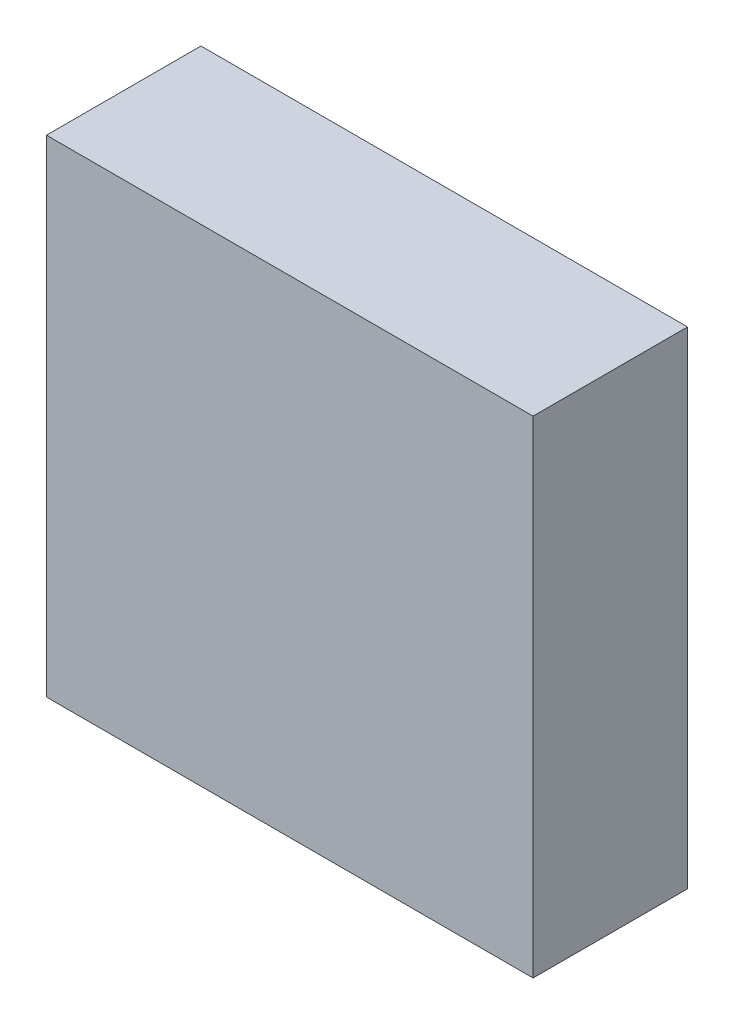
ISO-10303-21;
HEADER;
FILE_DESCRIPTION(('STEP AP214'),'2;1');
FILE_NAME('part.step','',(''),(''),'','','');
FILE_SCHEMA(('AUTOMOTIVE_DESIGN { 1 0 10303 214 1 1 1 1 }'));
ENDSEC;
DATA;
#1=APPLICATION_CONTEXT('core data for automotive mechanical design processes');
#2=APPLICATION_PROTOCOL_DEFINITION('international standard','automotive_design',2000,#1);
#3=PRODUCT_CONTEXT('',#1,'mechanical');
#4=PRODUCT('Part','Part','',(#3));
#5=PRODUCT_RELATED_PRODUCT_CATEGORY('part','',(#4));
#6=PRODUCT_DEFINITION_FORMATION('','',#4);
#7=PRODUCT_DEFINITION_CONTEXT('part definition',#1,'design');
#8=PRODUCT_DEFINITION('design','',#6,#7);
#9=PRODUCT_DEFINITION_SHAPE('','',#8);
#10=(LENGTH_UNIT() NAMED_UNIT(*) SI_UNIT(.MILLI.,.METRE.));
#11=(NAMED_UNIT(*) PLANE_ANGLE_UNIT() SI_UNIT($,.RADIAN.));
#12=(NAMED_UNIT(*) SI_UNIT($,.STERADIAN.) SOLID_ANGLE_UNIT());
#13=UNCERTAINTY_MEASURE_WITH_UNIT(LENGTH_MEASURE(1.E-05),#10,'distance_accuracy_value','');
#14=(GEOMETRIC_REPRESENTATION_CONTEXT(3) GLOBAL_UNCERTAINTY_ASSIGNED_CONTEXT((#13)) GLOBAL_UNIT_ASSIGNED_CONTEXT((#10,
#11,#12)) REPRESENTATION_CONTEXT('',''));
#15=CARTESIAN_POINT('',(0.,0.,0.));
#16=DIRECTION('',(0.,0.,1.));
#17=DIRECTION('',(1.,0.,0.));
#18=AXIS2_PLACEMENT_3D('',#15,#16,#17);
#19=CARTESIAN_POINT('',(1.57500066,1.57500066,1.00000054));
#20=DIRECTION('',(0.,0.,1.));
#21=DIRECTION('',(1.,0.,0.));
#22=AXIS2_PLACEMENT_3D('',#19,#20,#21);
#23=PLANE('',#22);
#24=DIRECTION('',(1.,0.,0.));
#25=VECTOR('',#24,1.);
#26=CARTESIAN_POINT('',(1.57500066,-1.57499812,1.00000054));
#27=LINE('',#26,#25);
#28=CARTESIAN_POINT('',(1.57500066,-1.57499812,1.00000054));
#29=VERTEX_POINT('',#28);
#30=CARTESIAN_POINT('',(-1.57499812,-1.57499812,1.00000054));
#31=VERTEX_POINT('',#30);
#32=EDGE_CURVE('E53',#29,#31,#27,.F.);
#33=ORIENTED_EDGE('',*,*,#32,.F.);
#34=DIRECTION('',(0.,1.,0.));
#35=VECTOR('',#34,1.);
#36=CARTESIAN_POINT('',(1.57500066,1.57500066,1.00000054));
#37=LINE('',#36,#35);
#38=CARTESIAN_POINT('',(1.57500066,1.57500066,1.00000054));
#39=VERTEX_POINT('',#38);
#40=EDGE_CURVE('E68',#39,#29,#37,.F.);
#41=ORIENTED_EDGE('',*,*,#40,.F.);
#42=DIRECTION('',(1.,0.,0.));
#43=VECTOR('',#42,1.);
#44=CARTESIAN_POINT('',(-1.57499812,1.57500066,1.00000054));
#45=LINE('',#44,#43);
#46=CARTESIAN_POINT('',(-1.57499812,1.57500066,1.00000054));
#47=VERTEX_POINT('',#46);
#48=EDGE_CURVE('E20',#47,#39,#45,.T.);
#49=ORIENTED_EDGE('',*,*,#48,.F.);
#50=DIRECTION('',(0.,1.,0.));
#51=VECTOR('',#50,1.);
#52=CARTESIAN_POINT('',(-1.57499812,-1.57499812,1.00000054));
#53=LINE('',#52,#51);
#54=EDGE_CURVE('E58',#31,#47,#53,.T.);
#55=ORIENTED_EDGE('',*,*,#54,.F.);
#56=EDGE_LOOP('',(#33,#41,#49,#55));
#57=FACE_BOUND('',#56,.T.);
#58=ADVANCED_FACE('F17',(#57),#23,.T.);
#59=CARTESIAN_POINT('',(-1.57499812,1.57500066,0.));
#60=DIRECTION('',(0.,1.,0.));
#61=DIRECTION('',(0.,0.,1.));
#62=AXIS2_PLACEMENT_3D('',#59,#60,#61);
#63=PLANE('',#62);
#64=DIRECTION('',(0.,0.,-1.));
#65=VECTOR('',#64,1.);
#66=CARTESIAN_POINT('',(1.57500066,1.57500066,0.));
#67=LINE('',#66,#65);
#68=CARTESIAN_POINT('',(1.57500066,1.57500066,0.));
#69=VERTEX_POINT('',#68);
#70=EDGE_CURVE('E79',#69,#39,#67,.F.);
#71=ORIENTED_EDGE('',*,*,#70,.F.);
#72=DIRECTION('',(1.,0.,0.));
#73=VECTOR('',#72,1.);
#74=CARTESIAN_POINT('',(1.57500066,1.57500066,0.));
#75=LINE('',#74,#73);
#76=CARTESIAN_POINT('',(-1.57499812,1.57500066,0.));
#77=VERTEX_POINT('',#76);
#78=EDGE_CURVE('E74',#69,#77,#75,.F.);
#79=ORIENTED_EDGE('',*,*,#78,.T.);
#80=DIRECTION('',(0.,0.,1.));
#81=VECTOR('',#80,1.);
#82=CARTESIAN_POINT('',(-1.57499812,1.57500066,0.));
#83=LINE('',#82,#81);
#84=EDGE_CURVE('E63',#47,#77,#83,.F.);
#85=ORIENTED_EDGE('',*,*,#84,.F.);
#86=ORIENTED_EDGE('',*,*,#48,.T.);
#87=EDGE_LOOP('',(#71,#79,#85,#86));
#88=FACE_BOUND('',#87,.T.);
#89=ADVANCED_FACE('F73',(#88),#63,.T.);
#90=CARTESIAN_POINT('',(-1.57499812,-1.57499812,0.));
#91=DIRECTION('',(-1.,0.,0.));
#92=DIRECTION('',(0.,0.,1.));
#93=AXIS2_PLACEMENT_3D('',#90,#91,#92);
#94=PLANE('',#93);
#95=ORIENTED_EDGE('',*,*,#84,.T.);
#96=DIRECTION('',(0.,1.,0.));
#97=VECTOR('',#96,1.);
#98=CARTESIAN_POINT('',(-1.57499812,1.57500066,0.));
#99=LINE('',#98,#97);
#100=CARTESIAN_POINT('',(-1.57499812,-1.57499812,0.));
#101=VERTEX_POINT('',#100);
#102=EDGE_CURVE('E84',#77,#101,#99,.F.);
#103=ORIENTED_EDGE('',*,*,#102,.T.);
#104=DIRECTION('',(0.,0.,-1.));
#105=VECTOR('',#104,1.);
#106=CARTESIAN_POINT('',(-1.57499812,-1.57499812,0.));
#107=LINE('',#106,#105);
#108=EDGE_CURVE('E65',#31,#101,#107,.T.);
#109=ORIENTED_EDGE('',*,*,#108,.F.);
#110=ORIENTED_EDGE('',*,*,#54,.T.);
#111=EDGE_LOOP('',(#95,#103,#109,#110));
#112=FACE_BOUND('',#111,.T.);
#113=ADVANCED_FACE('F60',(#112),#94,.T.);
#114=CARTESIAN_POINT('',(1.57500066,-1.57499812,0.));
#115=DIRECTION('',(0.,-1.,0.));
#116=DIRECTION('',(0.,0.,-1.));
#117=AXIS2_PLACEMENT_3D('',#114,#115,#116);
#118=PLANE('',#117);
#119=ORIENTED_EDGE('',*,*,#108,.T.);
#120=DIRECTION('',(1.,0.,0.));
#121=VECTOR('',#120,1.);
#122=CARTESIAN_POINT('',(1.57500066,-1.57499812,0.));
#123=LINE('',#122,#121);
#124=CARTESIAN_POINT('',(1.57500066,-1.57499812,0.));
#125=VERTEX_POINT('',#124);
#126=EDGE_CURVE('E26',#101,#125,#123,.T.);
#127=ORIENTED_EDGE('',*,*,#126,.T.);
#128=DIRECTION('',(0.,0.,-1.));
#129=VECTOR('',#128,1.);
#130=CARTESIAN_POINT('',(1.57500066,-1.57499812,0.));
#131=LINE('',#130,#129);
#132=EDGE_CURVE('E34',#29,#125,#131,.T.);
#133=ORIENTED_EDGE('',*,*,#132,.F.);
#134=ORIENTED_EDGE('',*,*,#32,.T.);
#135=EDGE_LOOP('',(#119,#127,#133,#134));
#136=FACE_BOUND('',#135,.T.);
#137=ADVANCED_FACE('F88',(#136),#118,.T.);
#138=CARTESIAN_POINT('',(1.57500066,1.57500066,0.));
#139=DIRECTION('',(1.,0.,0.));
#140=DIRECTION('',(0.,0.,-1.));
#141=AXIS2_PLACEMENT_3D('',#138,#139,#140);
#142=PLANE('',#141);
#143=ORIENTED_EDGE('',*,*,#132,.T.);
#144=DIRECTION('',(0.,1.,0.));
#145=VECTOR('',#144,1.);
#146=CARTESIAN_POINT('',(1.57500066,1.57500066,0.));
#147=LINE('',#146,#145);
#148=EDGE_CURVE('E11',#125,#69,#147,.T.);
#149=ORIENTED_EDGE('',*,*,#148,.T.);
#150=ORIENTED_EDGE('',*,*,#70,.T.);
#151=ORIENTED_EDGE('',*,*,#40,.T.);
#152=EDGE_LOOP('',(#143,#149,#150,#151));
#153=FACE_BOUND('',#152,.T.);
#154=ADVANCED_FACE('F91',(#153),#142,.T.);
#155=CARTESIAN_POINT('',(1.57500066,1.57500066,0.));
#156=DIRECTION('',(0.,0.,1.));
#157=DIRECTION('',(1.,0.,0.));
#158=AXIS2_PLACEMENT_3D('',#155,#156,#157);
#159=PLANE('',#158);
#160=ORIENTED_EDGE('',*,*,#126,.F.);
#161=ORIENTED_EDGE('',*,*,#102,.F.);
#162=ORIENTED_EDGE('',*,*,#78,.F.);
#163=ORIENTED_EDGE('',*,*,#148,.F.);
#164=EDGE_LOOP('',(#160,#161,#162,#163));
#165=FACE_BOUND('',#164,.T.);
#166=ADVANCED_FACE('F90',(#165),#159,.F.);
#167=CLOSED_SHELL('',(#58,#89,#113,#137,#154,#166));
#168=MANIFOLD_SOLID_BREP('B1',#167);
#169=ADVANCED_BREP_SHAPE_REPRESENTATION('',(#18,#168),#14);
#170=SHAPE_DEFINITION_REPRESENTATION(#9,#169);
ENDSEC;
END-ISO-10303-21;
